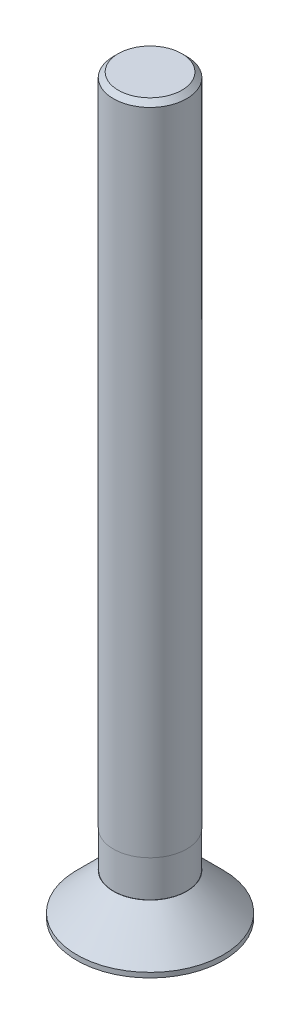
ISO-10303-21;
HEADER;
FILE_DESCRIPTION(('STEP AP214'),'2;1');
FILE_NAME('part.step','',(''),(''),'','','');
FILE_SCHEMA(('AUTOMOTIVE_DESIGN { 1 0 10303 214 1 1 1 1 }'));
ENDSEC;
DATA;
#1=APPLICATION_CONTEXT('core data for automotive mechanical design processes');
#2=APPLICATION_PROTOCOL_DEFINITION('international standard','automotive_design',2000,#1);
#3=PRODUCT_CONTEXT('',#1,'mechanical');
#4=PRODUCT('Part','Part','',(#3));
#5=PRODUCT_RELATED_PRODUCT_CATEGORY('part','',(#4));
#6=PRODUCT_DEFINITION_FORMATION('','',#4);
#7=PRODUCT_DEFINITION_CONTEXT('part definition',#1,'design');
#8=PRODUCT_DEFINITION('design','',#6,#7);
#9=PRODUCT_DEFINITION_SHAPE('','',#8);
#10=(LENGTH_UNIT() NAMED_UNIT(*) SI_UNIT(.MILLI.,.METRE.));
#11=(NAMED_UNIT(*) PLANE_ANGLE_UNIT() SI_UNIT($,.RADIAN.));
#12=(NAMED_UNIT(*) SI_UNIT($,.STERADIAN.) SOLID_ANGLE_UNIT());
#13=UNCERTAINTY_MEASURE_WITH_UNIT(LENGTH_MEASURE(1.E-05),#10,'distance_accuracy_value','');
#14=(GEOMETRIC_REPRESENTATION_CONTEXT(3) GLOBAL_UNCERTAINTY_ASSIGNED_CONTEXT((#13)) GLOBAL_UNIT_ASSIGNED_CONTEXT((#10,
#11,#12)) REPRESENTATION_CONTEXT('',''));
#15=CARTESIAN_POINT('',(0.,0.,0.));
#16=DIRECTION('',(0.,0.,1.));
#17=DIRECTION('',(1.,0.,0.));
#18=AXIS2_PLACEMENT_3D('',#15,#16,#17);
#19=CARTESIAN_POINT('',(0.,-1.87388386780294,0.));
#20=DIRECTION('',(0.,1.,0.));
#21=DIRECTION('',(0.,0.,1.));
#22=AXIS2_PLACEMENT_3D('',#19,#20,#21);
#23=PLANE('',#22);
#24=CARTESIAN_POINT('',(0.,-1.87388386780294,0.));
#25=DIRECTION('',(0.,-1.,0.));
#26=DIRECTION('',(0.,0.,-1.));
#27=AXIS2_PLACEMENT_3D('',#24,#25,#26);
#28=CIRCLE('',#27,1.15470053837925);
#29=CARTESIAN_POINT('',(0.577350269189622,-1.87388386780294,1.));
#30=VERTEX_POINT('',#29);
#31=CARTESIAN_POINT('',(-0.577351404949256,-1.87388386780294,1.00000196587773));
#32=VERTEX_POINT('',#31);
#33=EDGE_CURVE('E160',#30,#32,#28,.T.);
#34=ORIENTED_EDGE('',*,*,#33,.F.);
#35=CARTESIAN_POINT('',(1.15470053837925,-1.87388386780294,0.));
#36=VERTEX_POINT('',#35);
#37=EDGE_CURVE('E42',#36,#30,#28,.T.);
#38=ORIENTED_EDGE('',*,*,#37,.F.);
#39=CARTESIAN_POINT('',(0.577351404949261,-1.87388386780294,-1.00000196587773));
#40=VERTEX_POINT('',#39);
#41=EDGE_CURVE('E156',#40,#36,#28,.T.);
#42=ORIENTED_EDGE('',*,*,#41,.F.);
#43=CARTESIAN_POINT('',(-0.577349400992379,-1.87388386780294,-0.999998495164493));
#44=VERTEX_POINT('',#43);
#45=EDGE_CURVE('E56',#44,#40,#28,.T.);
#46=ORIENTED_EDGE('',*,*,#45,.F.);
#47=CARTESIAN_POINT('',(-1.15470053837925,-1.87388386780294,0.));
#48=VERTEX_POINT('',#47);
#49=EDGE_CURVE('E65',#48,#44,#28,.T.);
#50=ORIENTED_EDGE('',*,*,#49,.F.);
#51=EDGE_CURVE('E235',#32,#48,#28,.T.);
#52=ORIENTED_EDGE('',*,*,#51,.F.);
#53=EDGE_LOOP('',(#34,#38,#42,#46,#50,#52));
#54=FACE_BOUND('',#53,.T.);
#55=CARTESIAN_POINT('',(0.,-1.87388386780294,0.));
#56=DIRECTION('',(0.,-1.,0.));
#57=DIRECTION('',(0.,0.,-1.));
#58=AXIS2_PLACEMENT_3D('',#55,#56,#57);
#59=CIRCLE('',#58,3.);
#60=CARTESIAN_POINT('',(0.,-1.87388386780294,-3.));
#61=VERTEX_POINT('',#60);
#62=EDGE_CURVE('E445',#61,#61,#59,.T.);
#63=ORIENTED_EDGE('',*,*,#62,.T.);
#64=EDGE_LOOP('',(#63));
#65=FACE_BOUND('',#64,.T.);
#66=ADVANCED_FACE('F37',(#54,#65),#23,.F.);
#67=CARTESIAN_POINT('',(0.,0.,0.));
#68=DIRECTION('',(0.,-1.,0.));
#69=DIRECTION('',(0.,0.,-1.));
#70=AXIS2_PLACEMENT_3D('',#67,#68,#69);
#71=CYLINDRICAL_SURFACE('',#70,3.);
#72=ORIENTED_EDGE('',*,*,#62,.F.);
#73=EDGE_LOOP('',(#72));
#74=FACE_BOUND('',#73,.T.);
#75=CARTESIAN_POINT('',(0.,-1.67388386780294,0.));
#76=DIRECTION('',(0.,-1.,0.));
#77=DIRECTION('',(0.,0.,-1.));
#78=AXIS2_PLACEMENT_3D('',#75,#76,#77);
#79=CIRCLE('',#78,3.);
#80=CARTESIAN_POINT('',(0.,-1.67388386780294,-3.));
#81=VERTEX_POINT('',#80);
#82=EDGE_CURVE('E442',#81,#81,#79,.T.);
#83=ORIENTED_EDGE('',*,*,#82,.T.);
#84=EDGE_LOOP('',(#83));
#85=FACE_BOUND('',#84,.T.);
#86=ADVANCED_FACE('F180',(#74,#85),#71,.T.);
#87=CARTESIAN_POINT('',(0.,-0.173883867802944,0.));
#88=DIRECTION('',(0.,-1.,0.));
#89=DIRECTION('',(0.,0.,-1.));
#90=AXIS2_PLACEMENT_3D('',#87,#88,#89);
#91=CONICAL_SURFACE('',#90,1.5,0.785398163397447);
#92=ORIENTED_EDGE('',*,*,#82,.F.);
#93=EDGE_LOOP('',(#92));
#94=FACE_BOUND('',#93,.T.);
#95=CARTESIAN_POINT('',(0.,-0.173883867802944,0.));
#96=DIRECTION('',(0.,-1.,0.));
#97=DIRECTION('',(0.,0.,-1.));
#98=AXIS2_PLACEMENT_3D('',#95,#96,#97);
#99=CIRCLE('',#98,1.5);
#100=CARTESIAN_POINT('',(0.,-0.173883867802944,-1.5));
#101=VERTEX_POINT('',#100);
#102=EDGE_CURVE('E439',#101,#101,#99,.T.);
#103=ORIENTED_EDGE('',*,*,#102,.T.);
#104=EDGE_LOOP('',(#103));
#105=FACE_BOUND('',#104,.T.);
#106=ADVANCED_FACE('F481',(#94,#105),#91,.T.);
#107=CARTESIAN_POINT('',(-1.5,-0.173883867802944,0.));
#108=DIRECTION('',(0.,-1.,0.));
#109=DIRECTION('',(0.,0.,-1.));
#110=AXIS2_PLACEMENT_3D('',#107,#108,#109);
#111=PLANE('',#110);
#112=ORIENTED_EDGE('',*,*,#102,.F.);
#113=EDGE_LOOP('',(#112));
#114=FACE_BOUND('',#113,.T.);
#115=CARTESIAN_POINT('',(0.,-0.173883867802944,0.));
#116=DIRECTION('',(0.,-1.,0.));
#117=DIRECTION('',(0.,0.,-1.));
#118=AXIS2_PLACEMENT_3D('',#115,#116,#117);
#119=CIRCLE('',#118,1.49000000000001);
#120=CARTESIAN_POINT('',(0.,-0.173883867802944,-1.49000000000001));
#121=VERTEX_POINT('',#120);
#122=EDGE_CURVE('E436',#121,#121,#119,.T.);
#123=ORIENTED_EDGE('',*,*,#122,.T.);
#124=EDGE_LOOP('',(#123));
#125=FACE_BOUND('',#124,.T.);
#126=ADVANCED_FACE('F474',(#114,#125),#111,.F.);
#127=CARTESIAN_POINT('',(0.,0.,0.));
#128=DIRECTION('',(0.,-1.,0.));
#129=DIRECTION('',(0.,0.,-1.));
#130=AXIS2_PLACEMENT_3D('',#127,#128,#129);
#131=CYLINDRICAL_SURFACE('',#130,1.49000000000001);
#132=ORIENTED_EDGE('',*,*,#122,.F.);
#133=EDGE_LOOP('',(#132));
#134=FACE_BOUND('',#133,.T.);
#135=CARTESIAN_POINT('',(0.,1.32611613219706,0.));
#136=DIRECTION('',(0.,-1.,0.));
#137=DIRECTION('',(0.,0.,-1.));
#138=AXIS2_PLACEMENT_3D('',#135,#136,#137);
#139=CIRCLE('',#138,1.49000000000001);
#140=CARTESIAN_POINT('',(0.,1.32611613219706,-1.49000000000001));
#141=VERTEX_POINT('',#140);
#142=EDGE_CURVE('E222',#141,#141,#139,.T.);
#143=ORIENTED_EDGE('',*,*,#142,.T.);
#144=EDGE_LOOP('',(#143));
#145=FACE_BOUND('',#144,.T.);
#146=ADVANCED_FACE('F468',(#134,#145),#131,.T.);
#147=CARTESIAN_POINT('',(-1.5,1.32611613219706,0.));
#148=DIRECTION('',(0.,1.,0.));
#149=DIRECTION('',(0.,0.,1.));
#150=AXIS2_PLACEMENT_3D('',#147,#148,#149);
#151=PLANE('',#150);
#152=ORIENTED_EDGE('',*,*,#142,.F.);
#153=EDGE_LOOP('',(#152));
#154=FACE_BOUND('',#153,.T.);
#155=CARTESIAN_POINT('',(0.,1.32611613219706,0.));
#156=DIRECTION('',(0.,-1.,0.));
#157=DIRECTION('',(0.,0.,-1.));
#158=AXIS2_PLACEMENT_3D('',#155,#156,#157);
#159=CIRCLE('',#158,1.5);
#160=CARTESIAN_POINT('',(0.,1.32611613219706,-1.5));
#161=VERTEX_POINT('',#160);
#162=EDGE_CURVE('E218',#161,#161,#159,.T.);
#163=ORIENTED_EDGE('',*,*,#162,.T.);
#164=EDGE_LOOP('',(#163));
#165=FACE_BOUND('',#164,.T.);
#166=ADVANCED_FACE('F463',(#154,#165),#151,.F.);
#167=CARTESIAN_POINT('',(0.,0.,0.));
#168=DIRECTION('',(0.,-1.,0.));
#169=DIRECTION('',(0.,0.,-1.));
#170=AXIS2_PLACEMENT_3D('',#167,#168,#169);
#171=CYLINDRICAL_SURFACE('',#170,1.5);
#172=CARTESIAN_POINT('',(0.,27.9261161321971,0.));
#173=DIRECTION('',(0.,-1.,0.));
#174=DIRECTION('',(0.,0.,-1.));
#175=AXIS2_PLACEMENT_3D('',#172,#173,#174);
#176=CIRCLE('',#175,1.5);
#177=CARTESIAN_POINT('',(0.,27.9261161321971,-1.5));
#178=VERTEX_POINT('',#177);
#179=EDGE_CURVE('E448',#178,#178,#176,.T.);
#180=ORIENTED_EDGE('',*,*,#179,.T.);
#181=EDGE_LOOP('',(#180));
#182=FACE_BOUND('',#181,.T.);
#183=ORIENTED_EDGE('',*,*,#162,.F.);
#184=EDGE_LOOP('',(#183));
#185=FACE_BOUND('',#184,.T.);
#186=ADVANCED_FACE('F460',(#182,#185),#171,.T.);
#187=CARTESIAN_POINT('',(-1.5,28.1261161321971,0.));
#188=DIRECTION('',(0.,-1.,0.));
#189=DIRECTION('',(0.,0.,-1.));
#190=AXIS2_PLACEMENT_3D('',#187,#188,#189);
#191=PLANE('',#190);
#192=CARTESIAN_POINT('',(0.,28.1261161321971,0.));
#193=DIRECTION('',(0.,-1.,0.));
#194=DIRECTION('',(0.,0.,-1.));
#195=AXIS2_PLACEMENT_3D('',#192,#193,#194);
#196=CIRCLE('',#195,1.3);
#197=CARTESIAN_POINT('',(0.,28.1261161321971,-1.3));
#198=VERTEX_POINT('',#197);
#199=EDGE_CURVE('E135',#198,#198,#196,.F.);
#200=ORIENTED_EDGE('',*,*,#199,.T.);
#201=EDGE_LOOP('',(#200));
#202=FACE_BOUND('',#201,.T.);
#203=ADVANCED_FACE('F454',(#202),#191,.F.);
#204=CARTESIAN_POINT('',(0.,27.9261161321971,0.));
#205=DIRECTION('',(0.,-1.,0.));
#206=DIRECTION('',(0.,0.,-1.));
#207=AXIS2_PLACEMENT_3D('',#204,#205,#206);
#208=CONICAL_SURFACE('',#207,1.5,0.785398163397445);
#209=ORIENTED_EDGE('',*,*,#199,.F.);
#210=EDGE_LOOP('',(#209));
#211=FACE_BOUND('',#210,.T.);
#212=ORIENTED_EDGE('',*,*,#179,.F.);
#213=EDGE_LOOP('',(#212));
#214=FACE_BOUND('',#213,.T.);
#215=ADVANCED_FACE('F40',(#211,#214),#208,.T.);
#216=CARTESIAN_POINT('',(0.,-1.67388386780294,0.));
#217=DIRECTION('',(0.,-1.,0.));
#218=DIRECTION('',(0.,0.,-1.));
#219=AXIS2_PLACEMENT_3D('',#216,#217,#218);
#220=CONICAL_SURFACE('',#219,1.,0.658373937780637);
#221=ORIENTED_EDGE('',*,*,#37,.T.);
#222=CARTESIAN_POINT('',(1.15481600843309,-1.87403317222531,-0.000200000000004098));
#223=CARTESIAN_POINT('',(1.12316968084601,-1.83312074343118,0.0546130472537906));
#224=CARTESIAN_POINT('',(1.08981777101109,-1.7949634354735,0.112380249617313));
#225=CARTESIAN_POINT('',(1.01992640588559,-1.73108200853424,0.23343564502504));
#226=CARTESIAN_POINT('',(0.983356831795588,-1.70549438660236,0.296776005360072));
#227=CARTESIAN_POINT('',(0.922834286723981,-1.68090454364989,0.401604128427474));
#228=CARTESIAN_POINT('',(0.899599220479203,-1.67539508616111,0.441848443680657));
#229=CARTESIAN_POINT('',(0.853188056508933,-1.67292846256111,0.522234937715575));
#230=CARTESIAN_POINT('',(0.830012776254828,-1.67590886460221,0.562375700595333));
#231=CARTESIAN_POINT('',(0.7843927818388,-1.68969055585273,0.641391848764902));
#232=CARTESIAN_POINT('',(0.761945122594874,-1.70045466265438,0.680272335086375));
#233=CARTESIAN_POINT('',(0.717921697470909,-1.72826497434569,0.756523144124287));
#234=CARTESIAN_POINT('',(0.696352541805856,-1.74535152902818,0.793882017612521));
#235=CARTESIAN_POINT('',(0.658212463672071,-1.78048875912147,0.859942570744883));
#236=CARTESIAN_POINT('',(0.641457966963329,-1.79776924631449,0.888962210299669));
#237=CARTESIAN_POINT('',(0.608790299876737,-1.83445807832726,0.945544269458392));
#238=CARTESIAN_POINT('',(0.592869676372208,-1.85383970255314,0.973119598256412));
#239=CARTESIAN_POINT('',(0.577234799135784,-1.87403317222531,1.0002));
#240=B_SPLINE_CURVE_WITH_KNOTS('',3,(#222,#223,#224,#225,#226,#227,#228,#229,#230,#231,#232,
#233,#234,#235,#236,#237,#238,#239),.UNSPECIFIED.,.F.,.F.,(4,2,2,2,2,2,2,2,4),(0.,
0.22823977330086,0.458906090274109,0.598520267097166,0.737110419889317,0.875042870692217,
1.01387122981251,1.12688253422818,1.23859578016276),.UNSPECIFIED.);
#241=CARTESIAN_POINT('',(0.865926084268559,-1.67388389330864,0.50017202644768));
#242=VERTEX_POINT('',#241);
#243=EDGE_CURVE('E48',#242,#30,#240,.T.);
#244=ORIENTED_EDGE('',*,*,#243,.F.);
#245=CARTESIAN_POINT('',(0.866025403784436,-1.67388386780294,0.499999999999998));
#246=DIRECTION('',(-0.499999995877937,-0.000128402284208529,0.866025396645455));
#247=VECTOR('',#246,1.);
#248=LINE('',#245,#247);
#249=CARTESIAN_POINT('',(0.866023851838297,-1.67388386780294,0.499999104796667));
#250=VERTEX_POINT('',#249);
#251=EDGE_CURVE('E127',#250,#242,#248,.T.);
#252=ORIENTED_EDGE('',*,*,#251,.F.);
#253=EDGE_CURVE('E12',#36,#250,#240,.T.);
#254=ORIENTED_EDGE('',*,*,#253,.F.);
#255=EDGE_LOOP('',(#221,#244,#252,#254));
#256=FACE_BOUND('',#255,.T.);
#257=ADVANCED_FACE('F130',(#256),#220,.F.);
#258=CARTESIAN_POINT('',(1.74946039515207,-2.98622053745507,1.));
#259=CARTESIAN_POINT('',(1.71490598097623,-2.94743978576866,1.));
#260=CARTESIAN_POINT('',(1.68021399021888,-2.90878115811559,1.));
#261=CARTESIAN_POINT('',(1.61049820974119,-2.83175960602862,1.));
#262=CARTESIAN_POINT('',(1.57547439758845,-2.79339670190933,1.));
#263=CARTESIAN_POINT('',(1.46967789807064,-2.6786746318803,1.));
#264=CARTESIAN_POINT('',(1.39832631988853,-2.60284714209043,1.));
#265=CARTESIAN_POINT('',(1.25293800412587,-2.45276760921713,1.));
#266=CARTESIAN_POINT('',(1.17888614666626,-2.37853003041564,1.));
#267=CARTESIAN_POINT('',(1.06535145591423,-2.26979317138239,1.));
#268=CARTESIAN_POINT('',(1.02711265051045,-2.23399774768984,1.));
#269=CARTESIAN_POINT('',(0.949599007497123,-2.16355042984483,1.));
#270=CARTESIAN_POINT('',(0.910324307618786,-2.12889838503555,1.));
#271=CARTESIAN_POINT('',(0.842934248717363,-2.07169975206539,1.));
#272=CARTESIAN_POINT('',(0.815162250705751,-2.04875079848051,1.));
#273=CARTESIAN_POINT('',(0.758894164969058,-2.00376366855252,1.));
#274=CARTESIAN_POINT('',(0.730398036148671,-1.98172554408731,1.));
#275=CARTESIAN_POINT('',(0.643415978235554,-1.91712929875804,1.));
#276=CARTESIAN_POINT('',(0.583620551399759,-1.87624984500157,1.));
#277=CARTESIAN_POINT('',(0.489902556493574,-1.82023879260686,1.));
#278=CARTESIAN_POINT('',(0.457659968959687,-1.80230625143591,1.));
#279=CARTESIAN_POINT('',(0.391834100041796,-1.76903347978998,1.));
#280=CARTESIAN_POINT('',(0.358250545139573,-1.75369378155296,1.));
#281=CARTESIAN_POINT('',(0.289966565744284,-1.72648936471326,1.));
#282=CARTESIAN_POINT('',(0.255276316057332,-1.71459962866651,1.));
#283=CARTESIAN_POINT('',(0.18475409362299,-1.69500971677905,1.));
#284=CARTESIAN_POINT('',(0.148923497812488,-1.68730467709885,1.));
#285=CARTESIAN_POINT('',(0.0667196245725714,-1.67542128149863,1.));
#286=CARTESIAN_POINT('',(0.0201105441514157,-1.67275566650587,1.));
#287=CARTESIAN_POINT('',(-0.0728176433267195,-1.67590978598559,1.));
#288=CARTESIAN_POINT('',(-0.119136547605071,-1.68173490612168,1.));
#289=CARTESIAN_POINT('',(-0.222943513549701,-1.7035295534711,1.));
#290=CARTESIAN_POINT('',(-0.279918110274245,-1.72188720693132,1.));
#291=CARTESIAN_POINT('',(-0.362675523736122,-1.75585973378705,1.));
#292=CARTESIAN_POINT('',(-0.389877126336371,-1.76829699441004,1.));
#293=CARTESIAN_POINT('',(-0.443413083618481,-1.79491935238221,1.));
#294=CARTESIAN_POINT('',(-0.46974759758685,-1.80910412641262,1.));
#295=CARTESIAN_POINT('',(-0.534014683597469,-1.84599900448052,1.));
#296=CARTESIAN_POINT('',(-0.571466063059361,-1.86954023573211,1.));
#297=CARTESIAN_POINT('',(-0.644875712231838,-1.91886006629021,1.));
#298=CARTESIAN_POINT('',(-0.680833047866887,-1.94464003503864,1.));
#299=CARTESIAN_POINT('',(-0.786997660027537,-2.02453242756599,1.));
#300=CARTESIAN_POINT('',(-0.855344819680259,-2.08110309651398,1.));
#301=CARTESIAN_POINT('',(-0.989044454048233,-2.19829654430549,1.));
#302=CARTESIAN_POINT('',(-1.05437833072248,-2.25893995318044,1.));
#303=CARTESIAN_POINT('',(-1.18273377027038,-2.38265433977611,1.));
#304=CARTESIAN_POINT('',(-1.24575458792862,-2.44572608667292,1.));
#305=CARTESIAN_POINT('',(-1.38397613565864,-2.5876829643873,1.));
#306=CARTESIAN_POINT('',(-1.45876723860354,-2.66696433346289,1.));
#307=CARTESIAN_POINT('',(-1.56921270109722,-2.78655636427148,1.));
#308=CARTESIAN_POINT('',(-1.60551164033561,-2.8262767110034,1.));
#309=CARTESIAN_POINT('',(-1.6777430281649,-2.90602765426627,1.));
#310=CARTESIAN_POINT('',(-1.71367558378656,-2.94605815380769,1.));
#311=CARTESIAN_POINT('',(-1.74946039515208,-2.98622053745508,1.));
#312=B_SPLINE_CURVE_WITH_KNOTS('',3,(#258,#259,#260,#261,#262,#263,#264,#265,#266,#267,#268,
#269,#270,#271,#272,#273,#274,#275,#276,#277,#278,#279,#280,#281,#282,#283,#284,#285,#286,#287,
#288,#289,#290,#291,#292,#293,#294,#295,#296,#297,#298,#299,#300,#301,#302,#303,#304,#305,#306,
#307,#308,#309,#310,#311),.UNSPECIFIED.,.F.,.F.,(4,2,2,2,2,2,2,2,2,2,2,2,2,2,2,2,2,2,2,2,2,2,2,
2,2,2,4),(0.,0.155825516746859,0.311661644151836,0.623995166220761,0.938481829948363,
1.09560119142975,1.25269976679341,1.36076101105599,1.46882840168225,1.68569503990805,
1.79629172867447,1.9069110923428,2.01670701512948,2.12637504838361,2.26563688420522,
2.40498709209947,2.58344412422902,2.67313589249939,2.7628110911662,2.89540413569459,
3.02807886690881,3.2939642294632,3.56131620225153,3.82875356694802,4.15569124876772,
4.31711445070644,4.47848906154051),.UNSPECIFIED.);
#313=EDGE_CURVE('E258',#30,#32,#312,.T.);
#314=ORIENTED_EDGE('',*,*,#313,.F.);
#315=ORIENTED_EDGE('',*,*,#33,.T.);
#316=EDGE_LOOP('',(#314,#315));
#317=FACE_BOUND('',#316,.T.);
#318=ADVANCED_FACE('F257',(#317),#220,.F.);
#319=CARTESIAN_POINT('',(0.,-1.67388386780294,0.));
#320=DIRECTION('',(0.,1.,0.));
#321=DIRECTION('',(0.,0.,1.));
#322=AXIS2_PLACEMENT_3D('',#319,#320,#321);
#323=CIRCLE('',#322,1.);
#324=CARTESIAN_POINT('',(-0.866111623060335,-1.67388386780294,0.4998550957661));
#325=VERTEX_POINT('',#324);
#326=CARTESIAN_POINT('',(-0.866027322416126,-1.67388386780294,0.500001108595568));
#327=VERTEX_POINT('',#326);
#328=EDGE_CURVE('E265',#325,#327,#323,.T.);
#329=ORIENTED_EDGE('',*,*,#328,.T.);
#330=CARTESIAN_POINT('',(-0.577234799135788,-1.87403317222531,1.0002));
#331=CARTESIAN_POINT('',(-0.60888112672287,-1.83312074343118,0.945386952746207));
#332=CARTESIAN_POINT('',(-0.642233036557782,-1.7949634354735,0.887619750382685));
#333=CARTESIAN_POINT('',(-0.712124401683289,-1.73108200853424,0.766564354974958));
#334=CARTESIAN_POINT('',(-0.748693975773288,-1.70549438660236,0.703223994639925));
#335=CARTESIAN_POINT('',(-0.809216520844896,-1.68090454364989,0.598395871572523));
#336=CARTESIAN_POINT('',(-0.832451587089673,-1.67539508616111,0.55815155631934));
#337=CARTESIAN_POINT('',(-0.878862751059943,-1.67292846256111,0.477765062284422));
#338=CARTESIAN_POINT('',(-0.902038031314049,-1.67590886460222,0.437624299404664));
#339=CARTESIAN_POINT('',(-0.947658025730077,-1.68969055585273,0.358608151235094));
#340=CARTESIAN_POINT('',(-0.970105684974003,-1.70045466265438,0.319727664913622));
#341=CARTESIAN_POINT('',(-1.01412911009797,-1.7282649743457,0.243476855875709));
#342=CARTESIAN_POINT('',(-1.03569826576302,-1.74535152902818,0.206117982387474));
#343=CARTESIAN_POINT('',(-1.07383834389681,-1.78048875912148,0.140057429255114));
#344=CARTESIAN_POINT('',(-1.09059284060555,-1.79776924631449,0.111037789700329));
#345=CARTESIAN_POINT('',(-1.12326050769214,-1.83445807832727,0.0544557305416077));
#346=CARTESIAN_POINT('',(-1.13918113119667,-1.85383970255314,0.026880401743589));
#347=CARTESIAN_POINT('',(-1.15481600843309,-1.87403317222531,-0.000199999999999622));
#348=B_SPLINE_CURVE_WITH_KNOTS('',3,(#330,#331,#332,#333,#334,#335,#336,#337,#338,#339,#340,
#341,#342,#343,#344,#345,#346,#347),.UNSPECIFIED.,.F.,.F.,(4,2,2,2,2,2,2,2,4),(0.,
0.22823977330086,0.458906090274109,0.598520267097166,0.737110419889318,0.875042870692218,
1.01387122981251,1.12688253422818,1.23859578016276),.UNSPECIFIED.);
#349=EDGE_CURVE('E261',#32,#327,#348,.T.);
#350=ORIENTED_EDGE('',*,*,#349,.F.);
#351=ORIENTED_EDGE('',*,*,#51,.T.);
#352=EDGE_CURVE('E412',#325,#48,#348,.T.);
#353=ORIENTED_EDGE('',*,*,#352,.F.);
#354=EDGE_LOOP('',(#329,#350,#351,#353));
#355=FACE_BOUND('',#354,.T.);
#356=ADVANCED_FACE('F263',(#355),#220,.F.);
#357=CARTESIAN_POINT('',(-0.865924532410195,-1.67388386780294,-0.500171130883746));
#358=VERTEX_POINT('',#357);
#359=CARTESIAN_POINT('',(-0.866023851838296,-1.67388386780294,-0.499999104796667));
#360=VERTEX_POINT('',#359);
#361=EDGE_CURVE('E400',#358,#360,#323,.T.);
#362=ORIENTED_EDGE('',*,*,#361,.T.);
#363=CARTESIAN_POINT('',(-1.15481600843309,-1.87403317222531,0.000200000000000224));
#364=CARTESIAN_POINT('',(-1.12316968084601,-1.83312074343118,-0.0546130472537944));
#365=CARTESIAN_POINT('',(-1.0898177710111,-1.7949634354735,-0.112380249617317));
#366=CARTESIAN_POINT('',(-1.01992640588559,-1.73108200853424,-0.233435645025043));
#367=CARTESIAN_POINT('',(-0.98335683179559,-1.70549438660236,-0.296776005360076));
#368=CARTESIAN_POINT('',(-0.922834286723983,-1.68090454364989,-0.401604128427477));
#369=CARTESIAN_POINT('',(-0.899599220479205,-1.67539508616111,-0.441848443680661));
#370=CARTESIAN_POINT('',(-0.853188056508935,-1.67292846256111,-0.522234937715578));
#371=CARTESIAN_POINT('',(-0.83001277625483,-1.67590886460222,-0.562375700595336));
#372=CARTESIAN_POINT('',(-0.784392781838801,-1.68969055585273,-0.641391848764907));
#373=CARTESIAN_POINT('',(-0.761945122594876,-1.70045466265438,-0.680272335086379));
#374=CARTESIAN_POINT('',(-0.71792169747091,-1.7282649743457,-0.756523144124291));
#375=CARTESIAN_POINT('',(-0.696352541805856,-1.74535152902818,-0.793882017612526));
#376=CARTESIAN_POINT('',(-0.658212463672073,-1.78048875912148,-0.859942570744886));
#377=CARTESIAN_POINT('',(-0.641457966963332,-1.79776924631449,-0.888962210299671));
#378=CARTESIAN_POINT('',(-0.608790299876741,-1.83445807832727,-0.945544269458392));
#379=CARTESIAN_POINT('',(-0.592869676372212,-1.85383970255314,-0.973119598256411));
#380=CARTESIAN_POINT('',(-0.577234799135788,-1.87403317222531,-1.0002));
#381=B_SPLINE_CURVE_WITH_KNOTS('',3,(#363,#364,#365,#366,#367,#368,#369,#370,#371,#372,#373,
#374,#375,#376,#377,#378,#379,#380),.UNSPECIFIED.,.F.,.F.,(4,2,2,2,2,2,2,2,4),(0.,
0.228239773300859,0.458906090274109,0.598520267097166,0.737110419889317,0.875042870692218,
1.01387122981251,1.12688253422817,1.23859578016276),.UNSPECIFIED.);
#382=EDGE_CURVE('E403',#48,#360,#381,.T.);
#383=ORIENTED_EDGE('',*,*,#382,.F.);
#384=ORIENTED_EDGE('',*,*,#49,.T.);
#385=EDGE_CURVE('E406',#358,#44,#381,.T.);
#386=ORIENTED_EDGE('',*,*,#385,.F.);
#387=EDGE_LOOP('',(#362,#383,#384,#386));
#388=FACE_BOUND('',#387,.T.);
#389=ADVANCED_FACE('F402',(#388),#220,.F.);
#390=CARTESIAN_POINT('',(0.,-1.67388386780294,-1.));
#391=VERTEX_POINT('',#390);
#392=CARTESIAN_POINT('',(-0.000533167265095548,-1.67388386780294,-1.0000000022393));
#393=VERTEX_POINT('',#392);
#394=EDGE_CURVE('E237',#391,#393,#323,.T.);
#395=ORIENTED_EDGE('',*,*,#394,.T.);
#396=CARTESIAN_POINT('',(-1.74946039515208,-2.98622053745508,-1.));
#397=CARTESIAN_POINT('',(-1.71490598097624,-2.94743978576867,-1.));
#398=CARTESIAN_POINT('',(-1.68021399021889,-2.9087811581156,-1.));
#399=CARTESIAN_POINT('',(-1.6104982097412,-2.83175960602863,-1.));
#400=CARTESIAN_POINT('',(-1.57547439758846,-2.79339670190934,-1.));
#401=CARTESIAN_POINT('',(-1.46967789807065,-2.6786746318803,-1.));
#402=CARTESIAN_POINT('',(-1.39832631988854,-2.60284714209044,-1.));
#403=CARTESIAN_POINT('',(-1.25293800412588,-2.45276760921714,-1.));
#404=CARTESIAN_POINT('',(-1.17888614666626,-2.37853003041565,-1.));
#405=CARTESIAN_POINT('',(-1.06535145591424,-2.2697931713824,-1.));
#406=CARTESIAN_POINT('',(-1.02711265051046,-2.23399774768985,-0.999999999999999));
#407=CARTESIAN_POINT('',(-0.949599007497132,-2.16355042984484,-0.999999999999999));
#408=CARTESIAN_POINT('',(-0.910324307618795,-2.12889838503555,-0.999999999999999));
#409=CARTESIAN_POINT('',(-0.842934248717371,-2.07169975206539,-0.999999999999999));
#410=CARTESIAN_POINT('',(-0.81516225070576,-2.04875079848051,-0.999999999999999));
#411=CARTESIAN_POINT('',(-0.758894164969067,-2.00376366855252,-0.999999999999999));
#412=CARTESIAN_POINT('',(-0.73039803614868,-1.98172554408731,-0.999999999999999));
#413=CARTESIAN_POINT('',(-0.643415978235562,-1.91712929875804,-0.999999999999999));
#414=CARTESIAN_POINT('',(-0.583620551399768,-1.87624984500158,-0.999999999999999));
#415=CARTESIAN_POINT('',(-0.489902556493582,-1.82023879260686,-0.999999999999999));
#416=CARTESIAN_POINT('',(-0.457659968959695,-1.80230625143592,-0.999999999999999));
#417=CARTESIAN_POINT('',(-0.391834100041804,-1.76903347978998,-0.999999999999999));
#418=CARTESIAN_POINT('',(-0.358250545139581,-1.75369378155296,-0.999999999999999));
#419=CARTESIAN_POINT('',(-0.289966565744292,-1.72648936471326,-0.999999999999999));
#420=CARTESIAN_POINT('',(-0.25527631605734,-1.71459962866651,-0.999999999999999));
#421=CARTESIAN_POINT('',(-0.184754093622998,-1.69500971677905,-0.999999999999999));
#422=CARTESIAN_POINT('',(-0.148923497812496,-1.68730467709885,-0.999999999999999));
#423=CARTESIAN_POINT('',(-0.0667196245725796,-1.67542128149862,-0.999999999999999));
#424=CARTESIAN_POINT('',(-0.0201105441514239,-1.67275566650587,-0.999999999999999));
#425=CARTESIAN_POINT('',(0.0728176433267109,-1.67590978598558,-0.999999999999999));
#426=CARTESIAN_POINT('',(0.119136547605062,-1.68173490612168,-0.999999999999999));
#427=CARTESIAN_POINT('',(0.222943513549691,-1.70352955347109,-0.999999999999999));
#428=CARTESIAN_POINT('',(0.279918110274234,-1.72188720693132,-0.999999999999999));
#429=CARTESIAN_POINT('',(0.36267552373611,-1.75585973378704,-0.999999999999999));
#430=CARTESIAN_POINT('',(0.389877126336358,-1.76829699441003,-0.999999999999999));
#431=CARTESIAN_POINT('',(0.443413083618467,-1.7949193523822,-0.999999999999999));
#432=CARTESIAN_POINT('',(0.469747597586836,-1.8091041264126,-0.999999999999998));
#433=CARTESIAN_POINT('',(0.534014683597453,-1.8459990044805,-0.999999999999998));
#434=CARTESIAN_POINT('',(0.571466063059343,-1.8695402357321,-0.999999999999998));
#435=CARTESIAN_POINT('',(0.644875712231818,-1.91886006629019,-0.999999999999998));
#436=CARTESIAN_POINT('',(0.680833047866865,-1.94464003503862,-0.999999999999998));
#437=CARTESIAN_POINT('',(0.786997660027511,-2.02453242756597,-0.999999999999998));
#438=CARTESIAN_POINT('',(0.855344819680232,-2.08110309651396,-0.999999999999998));
#439=CARTESIAN_POINT('',(0.989044454048202,-2.19829654430546,-0.999999999999998));
#440=CARTESIAN_POINT('',(1.05437833072245,-2.2589399531804,-0.999999999999998));
#441=CARTESIAN_POINT('',(1.18273377027034,-2.38265433977607,-0.999999999999998));
#442=CARTESIAN_POINT('',(1.24575458792858,-2.44572608667288,-0.999999999999998));
#443=CARTESIAN_POINT('',(1.3839761356586,-2.58768296438726,-0.999999999999998));
#444=CARTESIAN_POINT('',(1.45876723860351,-2.66696433346286,-0.999999999999998));
#445=CARTESIAN_POINT('',(1.5692127010972,-2.78655636427147,-0.999999999999998));
#446=CARTESIAN_POINT('',(1.6055116403356,-2.82627671100339,-0.999999999999997));
#447=CARTESIAN_POINT('',(1.6777430281649,-2.90602765426626,-0.999999999999997));
#448=CARTESIAN_POINT('',(1.71367558378656,-2.94605815380769,-0.999999999999997));
#449=CARTESIAN_POINT('',(1.74946039515208,-2.98622053745508,-0.999999999999997));
#450=B_SPLINE_CURVE_WITH_KNOTS('',3,(#396,#397,#398,#399,#400,#401,#402,#403,#404,#405,#406,
#407,#408,#409,#410,#411,#412,#413,#414,#415,#416,#417,#418,#419,#420,#421,#422,#423,#424,#425,
#426,#427,#428,#429,#430,#431,#432,#433,#434,#435,#436,#437,#438,#439,#440,#441,#442,#443,#444,
#445,#446,#447,#448,#449),.UNSPECIFIED.,.F.,.F.,(4,2,2,2,2,2,2,2,2,2,2,2,2,2,2,2,2,2,2,2,2,2,2,
2,2,2,4),(0.,0.155825516746859,0.311661644151838,0.623995166220764,0.938481829948367,
1.09560119142975,1.25269976679341,1.36076101105599,1.46882840168226,1.68569503990806,
1.79629172867448,1.90691109234281,2.01670701512949,2.12637504838362,2.26563688420523,
2.40498709209948,2.58344412422902,2.67313589249939,2.7628110911662,2.89540413569458,
3.0280788669088,3.29396422946318,3.5613162022515,3.82875356694798,4.15569124876772,
4.31711445070645,4.47848906154054),.UNSPECIFIED.);
#451=EDGE_CURVE('E413',#44,#393,#450,.T.);
#452=ORIENTED_EDGE('',*,*,#451,.F.);
#453=ORIENTED_EDGE('',*,*,#45,.T.);
#454=EDGE_CURVE('E420',#391,#40,#450,.T.);
#455=ORIENTED_EDGE('',*,*,#454,.F.);
#456=EDGE_LOOP('',(#395,#452,#453,#455));
#457=FACE_BOUND('',#456,.T.);
#458=ADVANCED_FACE('F305',(#457),#220,.F.);
#459=ORIENTED_EDGE('',*,*,#41,.T.);
#460=CARTESIAN_POINT('',(0.57723479913579,-1.87403317222531,-1.0002));
#461=CARTESIAN_POINT('',(0.608881126722872,-1.83312074343118,-0.945386952746204));
#462=CARTESIAN_POINT('',(0.642233036557783,-1.7949634354735,-0.887619750382682));
#463=CARTESIAN_POINT('',(0.71212440168329,-1.73108200853424,-0.766564354974956));
#464=CARTESIAN_POINT('',(0.748693975773288,-1.70549438660236,-0.703223994639924));
#465=CARTESIAN_POINT('',(0.809216520844896,-1.68090454364989,-0.598395871572522));
#466=CARTESIAN_POINT('',(0.832451587089673,-1.67539508616111,-0.558151556319339));
#467=CARTESIAN_POINT('',(0.878862751059943,-1.67292846256111,-0.477765062284421));
#468=CARTESIAN_POINT('',(0.902038031314048,-1.67590886460222,-0.437624299404663));
#469=CARTESIAN_POINT('',(0.947658025730077,-1.68969055585273,-0.358608151235093));
#470=CARTESIAN_POINT('',(0.970105684974003,-1.70045466265438,-0.319727664913621));
#471=CARTESIAN_POINT('',(1.01412911009797,-1.7282649743457,-0.243476855875709));
#472=CARTESIAN_POINT('',(1.03569826576302,-1.74535152902818,-0.206117982387474));
#473=CARTESIAN_POINT('',(1.0738383438968,-1.78048875912148,-0.140057429255115));
#474=CARTESIAN_POINT('',(1.09059284060555,-1.79776924631449,-0.11103778970033));
#475=CARTESIAN_POINT('',(1.12326050769214,-1.83445807832726,-0.0544557305416104));
#476=CARTESIAN_POINT('',(1.13918113119666,-1.85383970255314,-0.0268804017435923));
#477=CARTESIAN_POINT('',(1.15481600843309,-1.87403317222531,0.000199999999995791));
#478=B_SPLINE_CURVE_WITH_KNOTS('',3,(#460,#461,#462,#463,#464,#465,#466,#467,#468,#469,#470,
#471,#472,#473,#474,#475,#476,#477),.UNSPECIFIED.,.F.,.F.,(4,2,2,2,2,2,2,2,4),(0.,
0.228239773300858,0.458906090274105,0.598520267097162,0.737110419889314,0.875042870692214,
1.0138712298125,1.12688253422817,1.23859578016275),.UNSPECIFIED.);
#479=CARTESIAN_POINT('',(0.866111623060337,-1.67388386780294,-0.499855095766098));
#480=VERTEX_POINT('',#479);
#481=EDGE_CURVE('E268',#480,#36,#478,.T.);
#482=ORIENTED_EDGE('',*,*,#481,.F.);
#483=CARTESIAN_POINT('',(0.866027322416126,-1.67388386780294,-0.500001108595569));
#484=VERTEX_POINT('',#483);
#485=EDGE_CURVE('E233',#480,#484,#323,.T.);
#486=ORIENTED_EDGE('',*,*,#485,.T.);
#487=EDGE_CURVE('E417',#40,#484,#478,.T.);
#488=ORIENTED_EDGE('',*,*,#487,.F.);
#489=EDGE_LOOP('',(#459,#482,#486,#488));
#490=FACE_BOUND('',#489,.T.);
#491=ADVANCED_FACE('F300',(#490),#220,.F.);
#492=CARTESIAN_POINT('',(0.,-0.673883867802944,0.));
#493=DIRECTION('',(0.,-1.,0.));
#494=DIRECTION('',(0.,0.,-1.));
#495=AXIS2_PLACEMENT_3D('',#492,#493,#494);
#496=PLANE('',#495);
#497=DIRECTION('',(0.5,0.,0.866025403784439));
#498=VECTOR('',#497,1.);
#499=CARTESIAN_POINT('',(0.577350269189628,-0.673883867802944,-0.999999999999998));
#500=LINE('',#499,#498);
#501=CARTESIAN_POINT('',(0.577350269189628,-0.673883867802944,-0.999999999999998));
#502=VERTEX_POINT('',#501);
#503=CARTESIAN_POINT('',(1.15470053837925,-0.673883867802944,0.));
#504=VERTEX_POINT('',#503);
#505=EDGE_CURVE('E419',#502,#504,#500,.T.);
#506=ORIENTED_EDGE('',*,*,#505,.T.);
#507=DIRECTION('',(-0.5,0.,0.866025403784439));
#508=VECTOR('',#507,1.);
#509=CARTESIAN_POINT('',(1.15470053837925,-0.673883867802944,0.));
#510=LINE('',#509,#508);
#511=CARTESIAN_POINT('',(0.577350269189622,-0.673883867802944,1.));
#512=VERTEX_POINT('',#511);
#513=EDGE_CURVE('E144',#504,#512,#510,.T.);
#514=ORIENTED_EDGE('',*,*,#513,.T.);
#515=DIRECTION('',(-1.,0.,0.));
#516=VECTOR('',#515,1.);
#517=CARTESIAN_POINT('',(0.577350269189622,-0.673883867802944,1.));
#518=LINE('',#517,#516);
#519=CARTESIAN_POINT('',(-0.577350269189626,-0.673883867802944,1.));
#520=VERTEX_POINT('',#519);
#521=EDGE_CURVE('E283',#512,#520,#518,.T.);
#522=ORIENTED_EDGE('',*,*,#521,.T.);
#523=DIRECTION('',(-0.5,0.,-0.866025403784439));
#524=VECTOR('',#523,1.);
#525=CARTESIAN_POINT('',(-0.577350269189626,-0.673883867802944,1.));
#526=LINE('',#525,#524);
#527=CARTESIAN_POINT('',(-1.15470053837925,-0.673883867802944,0.));
#528=VERTEX_POINT('',#527);
#529=EDGE_CURVE('E273',#520,#528,#526,.T.);
#530=ORIENTED_EDGE('',*,*,#529,.T.);
#531=DIRECTION('',(0.500000000000001,0.,-0.866025403784438));
#532=VECTOR('',#531,1.);
#533=CARTESIAN_POINT('',(-1.15470053837925,-0.673883867802944,0.));
#534=LINE('',#533,#532);
#535=CARTESIAN_POINT('',(-0.577350269189626,-0.673883867802944,-0.999999999999999));
#536=VERTEX_POINT('',#535);
#537=EDGE_CURVE('E429',#528,#536,#534,.T.);
#538=ORIENTED_EDGE('',*,*,#537,.T.);
#539=DIRECTION('',(1.,0.,0.));
#540=VECTOR('',#539,1.);
#541=CARTESIAN_POINT('',(-0.577350269189626,-0.673883867802944,-0.999999999999999));
#542=LINE('',#541,#540);
#543=EDGE_CURVE('E149',#536,#502,#542,.T.);
#544=ORIENTED_EDGE('',*,*,#543,.T.);
#545=EDGE_LOOP('',(#506,#514,#522,#530,#538,#544));
#546=FACE_BOUND('',#545,.T.);
#547=ADVANCED_FACE('F304',(#546),#496,.T.);
#548=CARTESIAN_POINT('',(1.15470053837925,-0.673883867802944,0.));
#549=DIRECTION('',(0.866025403784439,0.,0.5));
#550=DIRECTION('',(0.5,0.,-0.866025403784439));
#551=AXIS2_PLACEMENT_3D('',#548,#549,#550);
#552=PLANE('',#551);
#553=DIRECTION('',(0.,-1.,0.));
#554=VECTOR('',#553,1.);
#555=CARTESIAN_POINT('',(1.15470053837925,-0.673883867802944,0.));
#556=LINE('',#555,#554);
#557=EDGE_CURVE('E141',#504,#36,#556,.T.);
#558=ORIENTED_EDGE('',*,*,#557,.T.);
#559=ORIENTED_EDGE('',*,*,#253,.T.);
#560=ORIENTED_EDGE('',*,*,#251,.T.);
#561=ORIENTED_EDGE('',*,*,#243,.T.);
#562=DIRECTION('',(0.,-1.,0.));
#563=VECTOR('',#562,1.);
#564=CARTESIAN_POINT('',(0.577350269189622,-0.673883867802944,1.));
#565=LINE('',#564,#563);
#566=EDGE_CURVE('E148',#512,#30,#565,.T.);
#567=ORIENTED_EDGE('',*,*,#566,.F.);
#568=ORIENTED_EDGE('',*,*,#513,.F.);
#569=EDGE_LOOP('',(#558,#559,#560,#561,#567,#568));
#570=FACE_BOUND('',#569,.T.);
#571=ADVANCED_FACE('F139',(#570),#552,.F.);
#572=CARTESIAN_POINT('',(0.577350269189622,-0.673883867802944,1.));
#573=DIRECTION('',(0.,0.,1.));
#574=DIRECTION('',(1.,0.,0.));
#575=AXIS2_PLACEMENT_3D('',#572,#573,#574);
#576=PLANE('',#575);
#577=ORIENTED_EDGE('',*,*,#566,.T.);
#578=ORIENTED_EDGE('',*,*,#313,.T.);
#579=DIRECTION('',(0.,-1.,0.));
#580=VECTOR('',#579,1.);
#581=CARTESIAN_POINT('',(-0.577350269189626,-0.673883867802944,1.));
#582=LINE('',#581,#580);
#583=EDGE_CURVE('E230',#520,#32,#582,.T.);
#584=ORIENTED_EDGE('',*,*,#583,.F.);
#585=ORIENTED_EDGE('',*,*,#521,.F.);
#586=EDGE_LOOP('',(#577,#578,#584,#585));
#587=FACE_BOUND('',#586,.T.);
#588=ADVANCED_FACE('F282',(#587),#576,.F.);
#589=CARTESIAN_POINT('',(-0.577350269189626,-0.673883867802944,1.));
#590=DIRECTION('',(-0.866025403784439,0.,0.5));
#591=DIRECTION('',(0.5,0.,0.866025403784439));
#592=AXIS2_PLACEMENT_3D('',#589,#590,#591);
#593=PLANE('',#592);
#594=ORIENTED_EDGE('',*,*,#583,.T.);
#595=ORIENTED_EDGE('',*,*,#349,.T.);
#596=ORIENTED_EDGE('',*,*,#328,.F.);
#597=ORIENTED_EDGE('',*,*,#352,.T.);
#598=DIRECTION('',(0.,-1.,0.));
#599=VECTOR('',#598,1.);
#600=CARTESIAN_POINT('',(-1.15470053837925,-0.673883867802944,0.));
#601=LINE('',#600,#599);
#602=EDGE_CURVE('E225',#528,#48,#601,.T.);
#603=ORIENTED_EDGE('',*,*,#602,.F.);
#604=ORIENTED_EDGE('',*,*,#529,.F.);
#605=EDGE_LOOP('',(#594,#595,#596,#597,#603,#604));
#606=FACE_BOUND('',#605,.T.);
#607=ADVANCED_FACE('F271',(#606),#593,.F.);
#608=CARTESIAN_POINT('',(-1.15470053837925,-0.673883867802944,0.));
#609=DIRECTION('',(-0.866025403784438,0.,-0.5));
#610=DIRECTION('',(-0.500000000000001,0.,0.866025403784438));
#611=AXIS2_PLACEMENT_3D('',#608,#609,#610);
#612=PLANE('',#611);
#613=ORIENTED_EDGE('',*,*,#602,.T.);
#614=ORIENTED_EDGE('',*,*,#382,.T.);
#615=ORIENTED_EDGE('',*,*,#361,.F.);
#616=ORIENTED_EDGE('',*,*,#385,.T.);
#617=DIRECTION('',(0.,-1.,0.));
#618=VECTOR('',#617,1.);
#619=CARTESIAN_POINT('',(-0.577350269189626,-0.673883867802944,-0.999999999999999));
#620=LINE('',#619,#618);
#621=EDGE_CURVE('E219',#536,#44,#620,.T.);
#622=ORIENTED_EDGE('',*,*,#621,.F.);
#623=ORIENTED_EDGE('',*,*,#537,.F.);
#624=EDGE_LOOP('',(#613,#614,#615,#616,#622,#623));
#625=FACE_BOUND('',#624,.T.);
#626=ADVANCED_FACE('F410',(#625),#612,.F.);
#627=CARTESIAN_POINT('',(-0.577350269189626,-0.673883867802944,-0.999999999999999));
#628=DIRECTION('',(0.,0.,-1.));
#629=DIRECTION('',(-1.,0.,0.));
#630=AXIS2_PLACEMENT_3D('',#627,#628,#629);
#631=PLANE('',#630);
#632=ORIENTED_EDGE('',*,*,#621,.T.);
#633=ORIENTED_EDGE('',*,*,#451,.T.);
#634=ORIENTED_EDGE('',*,*,#394,.F.);
#635=ORIENTED_EDGE('',*,*,#454,.T.);
#636=DIRECTION('',(0.,-1.,0.));
#637=VECTOR('',#636,1.);
#638=CARTESIAN_POINT('',(0.577350269189628,-0.673883867802944,-0.999999999999998));
#639=LINE('',#638,#637);
#640=EDGE_CURVE('E216',#502,#40,#639,.T.);
#641=ORIENTED_EDGE('',*,*,#640,.F.);
#642=ORIENTED_EDGE('',*,*,#543,.F.);
#643=EDGE_LOOP('',(#632,#633,#634,#635,#641,#642));
#644=FACE_BOUND('',#643,.T.);
#645=ADVANCED_FACE('F422',(#644),#631,.F.);
#646=CARTESIAN_POINT('',(0.577350269189628,-0.673883867802944,-0.999999999999998));
#647=DIRECTION('',(0.866025403784439,0.,-0.5));
#648=DIRECTION('',(-0.5,0.,-0.866025403784439));
#649=AXIS2_PLACEMENT_3D('',#646,#647,#648);
#650=PLANE('',#649);
#651=ORIENTED_EDGE('',*,*,#640,.T.);
#652=ORIENTED_EDGE('',*,*,#487,.T.);
#653=ORIENTED_EDGE('',*,*,#485,.F.);
#654=ORIENTED_EDGE('',*,*,#481,.T.);
#655=ORIENTED_EDGE('',*,*,#557,.F.);
#656=ORIENTED_EDGE('',*,*,#505,.F.);
#657=EDGE_LOOP('',(#651,#652,#653,#654,#655,#656));
#658=FACE_BOUND('',#657,.T.);
#659=ADVANCED_FACE('F415',(#658),#650,.F.);
#660=CLOSED_SHELL('',(#66,#86,#106,#126,#146,#166,#186,#203,#215,#257,#318,#356,#389,#458,#491,
#547,#571,#588,#607,#626,#645,#659));
#661=MANIFOLD_SOLID_BREP('B2',#660);
#662=ADVANCED_BREP_SHAPE_REPRESENTATION('',(#18,#661),#14);
#663=SHAPE_DEFINITION_REPRESENTATION(#9,#662);
ENDSEC;
END-ISO-10303-21;
